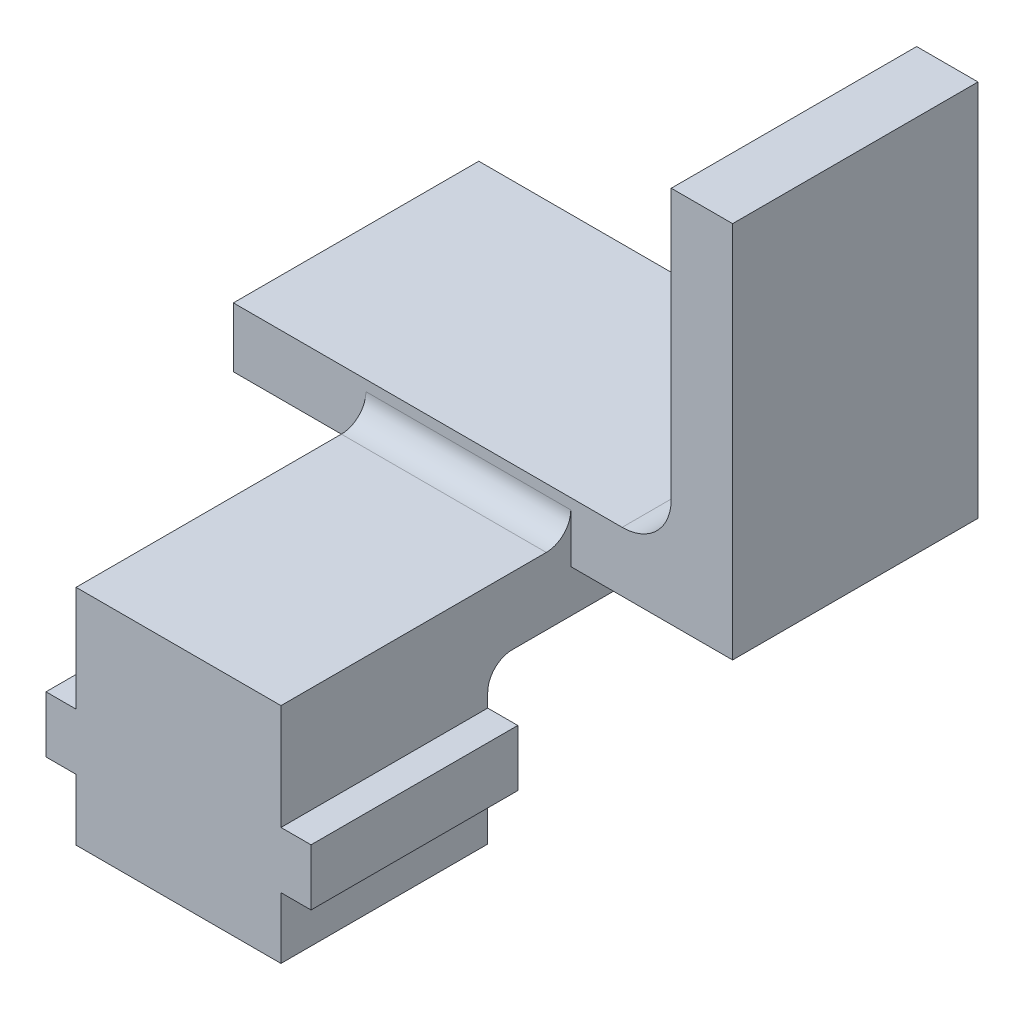
ISO-10303-21;
HEADER;
FILE_DESCRIPTION(('STEP AP214'),'2;1');
FILE_NAME('part.step','',(''),(''),'','','');
FILE_SCHEMA(('AUTOMOTIVE_DESIGN { 1 0 10303 214 1 1 1 1 }'));
ENDSEC;
DATA;
#1=APPLICATION_CONTEXT('core data for automotive mechanical design processes');
#2=APPLICATION_PROTOCOL_DEFINITION('international standard','automotive_design',2000,#1);
#3=PRODUCT_CONTEXT('',#1,'mechanical');
#4=PRODUCT('Part','Part','',(#3));
#5=PRODUCT_RELATED_PRODUCT_CATEGORY('part','',(#4));
#6=PRODUCT_DEFINITION_FORMATION('','',#4);
#7=PRODUCT_DEFINITION_CONTEXT('part definition',#1,'design');
#8=PRODUCT_DEFINITION('design','',#6,#7);
#9=PRODUCT_DEFINITION_SHAPE('','',#8);
#10=(LENGTH_UNIT() NAMED_UNIT(*) SI_UNIT(.MILLI.,.METRE.));
#11=(NAMED_UNIT(*) PLANE_ANGLE_UNIT() SI_UNIT($,.RADIAN.));
#12=(NAMED_UNIT(*) SI_UNIT($,.STERADIAN.) SOLID_ANGLE_UNIT());
#13=UNCERTAINTY_MEASURE_WITH_UNIT(LENGTH_MEASURE(1.E-05),#10,'distance_accuracy_value','');
#14=(GEOMETRIC_REPRESENTATION_CONTEXT(3) GLOBAL_UNCERTAINTY_ASSIGNED_CONTEXT((#13)) GLOBAL_UNIT_ASSIGNED_CONTEXT((#10,
#11,#12)) REPRESENTATION_CONTEXT('',''));
#15=CARTESIAN_POINT('',(0.,0.,0.));
#16=DIRECTION('',(0.,0.,1.));
#17=DIRECTION('',(1.,0.,0.));
#18=AXIS2_PLACEMENT_3D('',#15,#16,#17);
#19=CARTESIAN_POINT('',(0.,-4.191,12.7));
#20=DIRECTION('',(0.,-1.,0.));
#21=DIRECTION('',(1.,0.,0.));
#22=AXIS2_PLACEMENT_3D('',#19,#20,#21);
#23=PLANE('',#22);
#24=DIRECTION('',(1.,0.,0.));
#25=VECTOR('',#24,1.);
#26=CARTESIAN_POINT('',(0.,-4.191,17.));
#27=LINE('',#26,#25);
#28=CARTESIAN_POINT('',(-1.55575,-4.191,17.));
#29=VERTEX_POINT('',#28);
#30=CARTESIAN_POINT('',(0.,-4.191,17.));
#31=VERTEX_POINT('',#30);
#32=EDGE_CURVE('E464',#29,#31,#27,.T.);
#33=ORIENTED_EDGE('',*,*,#32,.F.);
#34=DIRECTION('',(0.,0.,-1.));
#35=VECTOR('',#34,1.);
#36=CARTESIAN_POINT('',(-1.55575,-4.191,12.7));
#37=LINE('',#36,#35);
#38=CARTESIAN_POINT('',(-1.55575,-4.191,27.7));
#39=VERTEX_POINT('',#38);
#40=EDGE_CURVE('E313',#39,#29,#37,.T.);
#41=ORIENTED_EDGE('',*,*,#40,.F.);
#42=DIRECTION('',(-1.,0.,0.));
#43=VECTOR('',#42,1.);
#44=CARTESIAN_POINT('',(0.,-4.191,27.7));
#45=LINE('',#44,#43);
#46=CARTESIAN_POINT('',(0.,-4.191,27.7));
#47=VERTEX_POINT('',#46);
#48=EDGE_CURVE('E454',#47,#39,#45,.T.);
#49=ORIENTED_EDGE('',*,*,#48,.F.);
#50=DIRECTION('',(0.,0.,-1.));
#51=VECTOR('',#50,1.);
#52=CARTESIAN_POINT('',(0.,-4.191,12.7));
#53=LINE('',#52,#51);
#54=EDGE_CURVE('E317',#47,#31,#53,.T.);
#55=ORIENTED_EDGE('',*,*,#54,.T.);
#56=EDGE_LOOP('',(#33,#41,#49,#55));
#57=FACE_BOUND('',#56,.T.);
#58=ADVANCED_FACE('F39',(#57),#23,.F.);
#59=CARTESIAN_POINT('',(-1.55575,-4.191,12.7));
#60=DIRECTION('',(1.,0.,0.));
#61=DIRECTION('',(0.,0.,-1.));
#62=AXIS2_PLACEMENT_3D('',#59,#60,#61);
#63=PLANE('',#62);
#64=DIRECTION('',(0.,1.,0.));
#65=VECTOR('',#64,1.);
#66=CARTESIAN_POINT('',(-1.55575,-4.191,17.));
#67=LINE('',#66,#65);
#68=CARTESIAN_POINT('',(-1.55575,-7.112,17.));
#69=VERTEX_POINT('',#68);
#70=EDGE_CURVE('E467',#69,#29,#67,.T.);
#71=ORIENTED_EDGE('',*,*,#70,.F.);
#72=DIRECTION('',(0.,0.,-1.));
#73=VECTOR('',#72,1.);
#74=CARTESIAN_POINT('',(-1.55575,-7.112,12.7));
#75=LINE('',#74,#73);
#76=CARTESIAN_POINT('',(-1.55575,-7.112,27.7));
#77=VERTEX_POINT('',#76);
#78=EDGE_CURVE('E309',#77,#69,#75,.T.);
#79=ORIENTED_EDGE('',*,*,#78,.F.);
#80=DIRECTION('',(0.,-1.,0.));
#81=VECTOR('',#80,1.);
#82=CARTESIAN_POINT('',(-1.55575,-4.191,27.7));
#83=LINE('',#82,#81);
#84=EDGE_CURVE('E450',#39,#77,#83,.T.);
#85=ORIENTED_EDGE('',*,*,#84,.F.);
#86=ORIENTED_EDGE('',*,*,#40,.T.);
#87=EDGE_LOOP('',(#71,#79,#85,#86));
#88=FACE_BOUND('',#87,.T.);
#89=ADVANCED_FACE('F534',(#88),#63,.F.);
#90=CARTESIAN_POINT('',(-1.55575,-7.112,12.7));
#91=DIRECTION('',(0.,1.,0.));
#92=DIRECTION('',(0.,0.,1.));
#93=AXIS2_PLACEMENT_3D('',#90,#91,#92);
#94=PLANE('',#93);
#95=DIRECTION('',(-1.,0.,0.));
#96=VECTOR('',#95,1.);
#97=CARTESIAN_POINT('',(-1.55575,-7.112,17.));
#98=LINE('',#97,#96);
#99=CARTESIAN_POINT('',(0.,-7.112,17.));
#100=VERTEX_POINT('',#99);
#101=EDGE_CURVE('E470',#100,#69,#98,.T.);
#102=ORIENTED_EDGE('',*,*,#101,.F.);
#103=DIRECTION('',(0.,0.,-1.));
#104=VECTOR('',#103,1.);
#105=CARTESIAN_POINT('',(0.,-7.112,12.7));
#106=LINE('',#105,#104);
#107=CARTESIAN_POINT('',(0.,-7.112,27.7));
#108=VERTEX_POINT('',#107);
#109=EDGE_CURVE('E305',#108,#100,#106,.T.);
#110=ORIENTED_EDGE('',*,*,#109,.F.);
#111=DIRECTION('',(1.,0.,0.));
#112=VECTOR('',#111,1.);
#113=CARTESIAN_POINT('',(-1.55575,-7.112,27.7));
#114=LINE('',#113,#112);
#115=EDGE_CURVE('E446',#77,#108,#114,.T.);
#116=ORIENTED_EDGE('',*,*,#115,.F.);
#117=ORIENTED_EDGE('',*,*,#78,.T.);
#118=EDGE_LOOP('',(#102,#110,#116,#117));
#119=FACE_BOUND('',#118,.T.);
#120=ADVANCED_FACE('F529',(#119),#94,.F.);
#121=CARTESIAN_POINT('',(0.,-7.112,12.7));
#122=DIRECTION('',(1.,0.,0.));
#123=DIRECTION('',(0.,1.,0.));
#124=AXIS2_PLACEMENT_3D('',#121,#122,#123);
#125=PLANE('',#124);
#126=DIRECTION('',(0.,1.,0.));
#127=VECTOR('',#126,1.);
#128=CARTESIAN_POINT('',(0.,-7.112,17.));
#129=LINE('',#128,#127);
#130=CARTESIAN_POINT('',(0.,-10.287,17.));
#131=VERTEX_POINT('',#130);
#132=EDGE_CURVE('E473',#131,#100,#129,.T.);
#133=ORIENTED_EDGE('',*,*,#132,.F.);
#134=DIRECTION('',(0.,0.,-1.));
#135=VECTOR('',#134,1.);
#136=CARTESIAN_POINT('',(0.,-10.287,12.7));
#137=LINE('',#136,#135);
#138=CARTESIAN_POINT('',(0.,-10.287,27.7));
#139=VERTEX_POINT('',#138);
#140=EDGE_CURVE('E301',#139,#131,#137,.T.);
#141=ORIENTED_EDGE('',*,*,#140,.F.);
#142=DIRECTION('',(0.,-1.,0.));
#143=VECTOR('',#142,1.);
#144=CARTESIAN_POINT('',(0.,-7.112,27.7));
#145=LINE('',#144,#143);
#146=EDGE_CURVE('E442',#108,#139,#145,.T.);
#147=ORIENTED_EDGE('',*,*,#146,.F.);
#148=ORIENTED_EDGE('',*,*,#109,.T.);
#149=EDGE_LOOP('',(#133,#141,#147,#148));
#150=FACE_BOUND('',#149,.T.);
#151=ADVANCED_FACE('F526',(#150),#125,.F.);
#152=CARTESIAN_POINT('',(0.,-10.287,12.7));
#153=DIRECTION('',(0.,1.,0.));
#154=DIRECTION('',(0.,0.,1.));
#155=AXIS2_PLACEMENT_3D('',#152,#153,#154);
#156=PLANE('',#155);
#157=DIRECTION('',(-1.,0.,0.));
#158=VECTOR('',#157,1.);
#159=CARTESIAN_POINT('',(0.,-10.287,17.));
#160=LINE('',#159,#158);
#161=CARTESIAN_POINT('',(10.6045,-10.287,17.));
#162=VERTEX_POINT('',#161);
#163=EDGE_CURVE('E476',#162,#131,#160,.T.);
#164=ORIENTED_EDGE('',*,*,#163,.F.);
#165=DIRECTION('',(0.,0.,-1.));
#166=VECTOR('',#165,1.);
#167=CARTESIAN_POINT('',(10.6045,-10.287,12.7));
#168=LINE('',#167,#166);
#169=CARTESIAN_POINT('',(10.6045,-10.287,27.7));
#170=VERTEX_POINT('',#169);
#171=EDGE_CURVE('E297',#170,#162,#168,.T.);
#172=ORIENTED_EDGE('',*,*,#171,.F.);
#173=DIRECTION('',(1.,0.,0.));
#174=VECTOR('',#173,1.);
#175=CARTESIAN_POINT('',(0.,-10.287,27.7));
#176=LINE('',#175,#174);
#177=EDGE_CURVE('E438',#139,#170,#176,.T.);
#178=ORIENTED_EDGE('',*,*,#177,.F.);
#179=ORIENTED_EDGE('',*,*,#140,.T.);
#180=EDGE_LOOP('',(#164,#172,#178,#179));
#181=FACE_BOUND('',#180,.T.);
#182=ADVANCED_FACE('F522',(#181),#156,.F.);
#183=CARTESIAN_POINT('',(10.6045,-10.287,12.7));
#184=DIRECTION('',(-1.,0.,0.));
#185=DIRECTION('',(0.,0.,1.));
#186=AXIS2_PLACEMENT_3D('',#183,#184,#185);
#187=PLANE('',#186);
#188=DIRECTION('',(0.,-1.,0.));
#189=VECTOR('',#188,1.);
#190=CARTESIAN_POINT('',(10.6045,-10.287,17.));
#191=LINE('',#190,#189);
#192=CARTESIAN_POINT('',(10.6045,-7.112,17.));
#193=VERTEX_POINT('',#192);
#194=EDGE_CURVE('E479',#193,#162,#191,.T.);
#195=ORIENTED_EDGE('',*,*,#194,.F.);
#196=DIRECTION('',(0.,0.,-1.));
#197=VECTOR('',#196,1.);
#198=CARTESIAN_POINT('',(10.6045,-7.112,12.7));
#199=LINE('',#198,#197);
#200=CARTESIAN_POINT('',(10.6045,-7.112,27.7));
#201=VERTEX_POINT('',#200);
#202=EDGE_CURVE('E293',#201,#193,#199,.T.);
#203=ORIENTED_EDGE('',*,*,#202,.F.);
#204=DIRECTION('',(0.,1.,0.));
#205=VECTOR('',#204,1.);
#206=CARTESIAN_POINT('',(10.6045,-10.287,27.7));
#207=LINE('',#206,#205);
#208=EDGE_CURVE('E434',#170,#201,#207,.T.);
#209=ORIENTED_EDGE('',*,*,#208,.F.);
#210=ORIENTED_EDGE('',*,*,#171,.T.);
#211=EDGE_LOOP('',(#195,#203,#209,#210));
#212=FACE_BOUND('',#211,.T.);
#213=ADVANCED_FACE('F517',(#212),#187,.F.);
#214=CARTESIAN_POINT('',(10.6045,-7.112,12.7));
#215=DIRECTION('',(0.,1.,0.));
#216=DIRECTION('',(0.,0.,1.));
#217=AXIS2_PLACEMENT_3D('',#214,#215,#216);
#218=PLANE('',#217);
#219=DIRECTION('',(-1.,0.,0.));
#220=VECTOR('',#219,1.);
#221=CARTESIAN_POINT('',(10.6045,-7.112,17.));
#222=LINE('',#221,#220);
#223=CARTESIAN_POINT('',(12.16025,-7.112,17.));
#224=VERTEX_POINT('',#223);
#225=EDGE_CURVE('E482',#224,#193,#222,.T.);
#226=ORIENTED_EDGE('',*,*,#225,.F.);
#227=DIRECTION('',(0.,0.,-1.));
#228=VECTOR('',#227,1.);
#229=CARTESIAN_POINT('',(12.16025,-7.112,12.7));
#230=LINE('',#229,#228);
#231=CARTESIAN_POINT('',(12.16025,-7.112,27.7));
#232=VERTEX_POINT('',#231);
#233=EDGE_CURVE('E289',#232,#224,#230,.T.);
#234=ORIENTED_EDGE('',*,*,#233,.F.);
#235=DIRECTION('',(1.,0.,0.));
#236=VECTOR('',#235,1.);
#237=CARTESIAN_POINT('',(10.6045,-7.112,27.7));
#238=LINE('',#237,#236);
#239=EDGE_CURVE('E430',#201,#232,#238,.T.);
#240=ORIENTED_EDGE('',*,*,#239,.F.);
#241=ORIENTED_EDGE('',*,*,#202,.T.);
#242=EDGE_LOOP('',(#226,#234,#240,#241));
#243=FACE_BOUND('',#242,.T.);
#244=ADVANCED_FACE('F514',(#243),#218,.F.);
#245=CARTESIAN_POINT('',(12.16025,-7.112,12.7));
#246=DIRECTION('',(-1.,0.,0.));
#247=DIRECTION('',(0.,0.,1.));
#248=AXIS2_PLACEMENT_3D('',#245,#246,#247);
#249=PLANE('',#248);
#250=DIRECTION('',(0.,-1.,0.));
#251=VECTOR('',#250,1.);
#252=CARTESIAN_POINT('',(12.16025,-7.112,17.));
#253=LINE('',#252,#251);
#254=CARTESIAN_POINT('',(12.16025,-4.191,17.));
#255=VERTEX_POINT('',#254);
#256=EDGE_CURVE('E485',#255,#224,#253,.T.);
#257=ORIENTED_EDGE('',*,*,#256,.F.);
#258=DIRECTION('',(0.,0.,-1.));
#259=VECTOR('',#258,1.);
#260=CARTESIAN_POINT('',(12.16025,-4.191,12.7));
#261=LINE('',#260,#259);
#262=CARTESIAN_POINT('',(12.16025,-4.191,27.7));
#263=VERTEX_POINT('',#262);
#264=EDGE_CURVE('E285',#263,#255,#261,.T.);
#265=ORIENTED_EDGE('',*,*,#264,.F.);
#266=DIRECTION('',(0.,1.,0.));
#267=VECTOR('',#266,1.);
#268=CARTESIAN_POINT('',(12.16025,-7.112,27.7));
#269=LINE('',#268,#267);
#270=EDGE_CURVE('E426',#232,#263,#269,.T.);
#271=ORIENTED_EDGE('',*,*,#270,.F.);
#272=ORIENTED_EDGE('',*,*,#233,.T.);
#273=EDGE_LOOP('',(#257,#265,#271,#272));
#274=FACE_BOUND('',#273,.T.);
#275=ADVANCED_FACE('F510',(#274),#249,.F.);
#276=CARTESIAN_POINT('',(12.16025,-4.191,12.7));
#277=DIRECTION('',(0.,-1.,0.));
#278=DIRECTION('',(1.,0.,0.));
#279=AXIS2_PLACEMENT_3D('',#276,#277,#278);
#280=PLANE('',#279);
#281=DIRECTION('',(1.,0.,0.));
#282=VECTOR('',#281,1.);
#283=CARTESIAN_POINT('',(12.16025,-4.191,17.));
#284=LINE('',#283,#282);
#285=CARTESIAN_POINT('',(10.6045,-4.191,17.));
#286=VERTEX_POINT('',#285);
#287=EDGE_CURVE('E488',#286,#255,#284,.T.);
#288=ORIENTED_EDGE('',*,*,#287,.F.);
#289=DIRECTION('',(0.,0.,-1.));
#290=VECTOR('',#289,1.);
#291=CARTESIAN_POINT('',(10.6045,-4.191,12.7));
#292=LINE('',#291,#290);
#293=CARTESIAN_POINT('',(10.6045,-4.191,27.7));
#294=VERTEX_POINT('',#293);
#295=EDGE_CURVE('E281',#294,#286,#292,.T.);
#296=ORIENTED_EDGE('',*,*,#295,.F.);
#297=DIRECTION('',(-1.,0.,0.));
#298=VECTOR('',#297,1.);
#299=CARTESIAN_POINT('',(12.16025,-4.191,27.7));
#300=LINE('',#299,#298);
#301=EDGE_CURVE('E422',#263,#294,#300,.T.);
#302=ORIENTED_EDGE('',*,*,#301,.F.);
#303=ORIENTED_EDGE('',*,*,#264,.T.);
#304=EDGE_LOOP('',(#288,#296,#302,#303));
#305=FACE_BOUND('',#304,.T.);
#306=ADVANCED_FACE('F503',(#305),#280,.F.);
#307=CARTESIAN_POINT('',(0.,0.,12.7));
#308=DIRECTION('',(0.,0.,-1.));
#309=DIRECTION('',(-1.,0.,0.));
#310=AXIS2_PLACEMENT_3D('',#307,#308,#309);
#311=PLANE('',#310);
#312=DIRECTION('',(0.,-1.,0.));
#313=VECTOR('',#312,1.);
#314=CARTESIAN_POINT('',(0.,0.,12.7));
#315=LINE('',#314,#313);
#316=CARTESIAN_POINT('',(0.,2.54,12.7));
#317=VERTEX_POINT('',#316);
#318=CARTESIAN_POINT('',(0.,0.,12.7));
#319=VERTEX_POINT('',#318);
#320=EDGE_CURVE('E55',#317,#319,#315,.T.);
#321=ORIENTED_EDGE('',*,*,#320,.F.);
#322=DIRECTION('',(-1.,0.,0.));
#323=VECTOR('',#322,1.);
#324=CARTESIAN_POINT('',(10.6045,2.54,12.7));
#325=LINE('',#324,#323);
#326=CARTESIAN_POINT('',(10.6045,2.54,12.7));
#327=VERTEX_POINT('',#326);
#328=EDGE_CURVE('E351',#317,#327,#325,.F.);
#329=ORIENTED_EDGE('',*,*,#328,.T.);
#330=DIRECTION('',(0.,1.,0.));
#331=VECTOR('',#330,1.);
#332=CARTESIAN_POINT('',(10.6045,1.27,12.7));
#333=LINE('',#332,#331);
#334=CARTESIAN_POINT('',(10.6045,0.,12.7));
#335=VERTEX_POINT('',#334);
#336=EDGE_CURVE('E62',#335,#327,#333,.T.);
#337=ORIENTED_EDGE('',*,*,#336,.F.);
#338=DIRECTION('',(1.,0.,0.));
#339=VECTOR('',#338,1.);
#340=CARTESIAN_POINT('',(10.6045,0.,12.7));
#341=LINE('',#340,#339);
#342=CARTESIAN_POINT('',(18.97725,0.,12.7));
#343=VERTEX_POINT('',#342);
#344=EDGE_CURVE('E370',#335,#343,#341,.T.);
#345=ORIENTED_EDGE('',*,*,#344,.T.);
#346=DIRECTION('',(0.,1.,0.));
#347=VECTOR('',#346,1.);
#348=CARTESIAN_POINT('',(18.97725,0.,12.7));
#349=LINE('',#348,#347);
#350=CARTESIAN_POINT('',(18.97725,19.558,12.7));
#351=VERTEX_POINT('',#350);
#352=EDGE_CURVE('E378',#343,#351,#349,.T.);
#353=ORIENTED_EDGE('',*,*,#352,.T.);
#354=DIRECTION('',(-1.,0.,0.));
#355=VECTOR('',#354,1.);
#356=CARTESIAN_POINT('',(18.97725,19.558,12.7));
#357=LINE('',#356,#355);
#358=CARTESIAN_POINT('',(15.80225,19.558,12.7));
#359=VERTEX_POINT('',#358);
#360=EDGE_CURVE('E382',#351,#359,#357,.T.);
#361=ORIENTED_EDGE('',*,*,#360,.T.);
#362=DIRECTION('',(0.,-1.,0.));
#363=VECTOR('',#362,1.);
#364=CARTESIAN_POINT('',(15.80225,19.558,12.7));
#365=LINE('',#364,#363);
#366=CARTESIAN_POINT('',(15.80225,5.629,12.7));
#367=VERTEX_POINT('',#366);
#368=EDGE_CURVE('E389',#359,#367,#365,.T.);
#369=ORIENTED_EDGE('',*,*,#368,.T.);
#370=CARTESIAN_POINT('',(13.26225,5.629,12.7));
#371=DIRECTION('',(0.,0.,-1.));
#372=DIRECTION('',(-1.,0.,0.));
#373=AXIS2_PLACEMENT_3D('',#370,#371,#372);
#374=CIRCLE('',#373,2.54);
#375=CARTESIAN_POINT('',(13.26225,3.089,12.7));
#376=VERTEX_POINT('',#375);
#377=EDGE_CURVE('E335',#367,#376,#374,.T.);
#378=ORIENTED_EDGE('',*,*,#377,.T.);
#379=DIRECTION('',(-1.,0.,0.));
#380=VECTOR('',#379,1.);
#381=CARTESIAN_POINT('',(15.80225,3.089,12.7));
#382=LINE('',#381,#380);
#383=CARTESIAN_POINT('',(-6.858,3.089,12.7));
#384=VERTEX_POINT('',#383);
#385=EDGE_CURVE('E393',#376,#384,#382,.T.);
#386=ORIENTED_EDGE('',*,*,#385,.T.);
#387=DIRECTION('',(0.,-1.,0.));
#388=VECTOR('',#387,1.);
#389=CARTESIAN_POINT('',(-6.858,3.089,12.7));
#390=LINE('',#389,#388);
#391=CARTESIAN_POINT('',(-6.858,0.,12.7));
#392=VERTEX_POINT('',#391);
#393=EDGE_CURVE('E262',#384,#392,#390,.T.);
#394=ORIENTED_EDGE('',*,*,#393,.T.);
#395=DIRECTION('',(1.,0.,0.));
#396=VECTOR('',#395,1.);
#397=CARTESIAN_POINT('',(-6.858,0.,12.7));
#398=LINE('',#397,#396);
#399=EDGE_CURVE('E256',#392,#319,#398,.T.);
#400=ORIENTED_EDGE('',*,*,#399,.T.);
#401=EDGE_LOOP('',(#321,#329,#337,#345,#353,#361,#369,#378,#386,#394,#400));
#402=FACE_BOUND('',#401,.T.);
#403=ADVANCED_FACE('F368',(#402),#311,.F.);
#404=CARTESIAN_POINT('',(-6.858,0.,12.7));
#405=DIRECTION('',(0.,1.,0.));
#406=DIRECTION('',(0.,0.,1.));
#407=AXIS2_PLACEMENT_3D('',#404,#405,#406);
#408=PLANE('',#407);
#409=DIRECTION('',(1.,0.,0.));
#410=VECTOR('',#409,1.);
#411=CARTESIAN_POINT('',(-6.858,0.,0.));
#412=LINE('',#411,#410);
#413=CARTESIAN_POINT('',(-6.858,0.,0.));
#414=VERTEX_POINT('',#413);
#415=CARTESIAN_POINT('',(0.,0.,0.));
#416=VERTEX_POINT('',#415);
#417=EDGE_CURVE('E237',#414,#416,#412,.T.);
#418=ORIENTED_EDGE('',*,*,#417,.T.);
#419=DIRECTION('',(0.,0.,-1.));
#420=VECTOR('',#419,1.);
#421=CARTESIAN_POINT('',(0.,0.,12.7));
#422=LINE('',#421,#420);
#423=EDGE_CURVE('E321',#319,#416,#422,.T.);
#424=ORIENTED_EDGE('',*,*,#423,.F.);
#425=ORIENTED_EDGE('',*,*,#399,.F.);
#426=DIRECTION('',(0.,0.,-1.));
#427=VECTOR('',#426,1.);
#428=CARTESIAN_POINT('',(-6.858,0.,12.7));
#429=LINE('',#428,#427);
#430=EDGE_CURVE('E257',#392,#414,#429,.T.);
#431=ORIENTED_EDGE('',*,*,#430,.T.);
#432=EDGE_LOOP('',(#418,#424,#425,#431));
#433=FACE_BOUND('',#432,.T.);
#434=ADVANCED_FACE('F559',(#433),#408,.F.);
#435=CARTESIAN_POINT('',(0.,0.,12.7));
#436=DIRECTION('',(1.,0.,0.));
#437=DIRECTION('',(0.,1.,0.));
#438=AXIS2_PLACEMENT_3D('',#435,#436,#437);
#439=PLANE('',#438);
#440=DIRECTION('',(0.,-1.,0.));
#441=VECTOR('',#440,1.);
#442=CARTESIAN_POINT('',(0.,0.,0.));
#443=LINE('',#442,#441);
#444=CARTESIAN_POINT('',(0.,-2.211,0.));
#445=VERTEX_POINT('',#444);
#446=EDGE_CURVE('E231',#416,#445,#443,.T.);
#447=ORIENTED_EDGE('',*,*,#446,.T.);
#448=DIRECTION('',(0.,0.,1.));
#449=VECTOR('',#448,1.);
#450=CARTESIAN_POINT('',(0.,-2.211,12.7));
#451=LINE('',#450,#449);
#452=CARTESIAN_POINT('',(0.,-2.211,15.73));
#453=VERTEX_POINT('',#452);
#454=EDGE_CURVE('E215',#445,#453,#451,.T.);
#455=ORIENTED_EDGE('',*,*,#454,.T.);
#456=CARTESIAN_POINT('',(0.,-3.481,15.73));
#457=DIRECTION('',(1.,0.,0.));
#458=DIRECTION('',(0.,1.,0.));
#459=AXIS2_PLACEMENT_3D('',#456,#457,#458);
#460=CIRCLE('',#459,1.27);
#461=CARTESIAN_POINT('',(0.,-3.481,17.));
#462=VERTEX_POINT('',#461);
#463=EDGE_CURVE('E356',#453,#462,#460,.T.);
#464=ORIENTED_EDGE('',*,*,#463,.T.);
#465=DIRECTION('',(0.,1.,0.));
#466=VECTOR('',#465,1.);
#467=CARTESIAN_POINT('',(0.,0.,17.));
#468=LINE('',#467,#466);
#469=EDGE_CURVE('E414',#31,#462,#468,.T.);
#470=ORIENTED_EDGE('',*,*,#469,.F.);
#471=ORIENTED_EDGE('',*,*,#54,.F.);
#472=DIRECTION('',(0.,-1.,0.));
#473=VECTOR('',#472,1.);
#474=CARTESIAN_POINT('',(0.,0.,27.7));
#475=LINE('',#474,#473);
#476=CARTESIAN_POINT('',(0.,1.27,27.7));
#477=VERTEX_POINT('',#476);
#478=EDGE_CURVE('E413',#477,#47,#475,.T.);
#479=ORIENTED_EDGE('',*,*,#478,.F.);
#480=DIRECTION('',(0.,0.,-1.));
#481=VECTOR('',#480,1.);
#482=CARTESIAN_POINT('',(0.,1.27,27.7));
#483=LINE('',#482,#481);
#484=CARTESIAN_POINT('',(0.,1.27,13.97));
#485=VERTEX_POINT('',#484);
#486=EDGE_CURVE('E364',#477,#485,#483,.T.);
#487=ORIENTED_EDGE('',*,*,#486,.T.);
#488=CARTESIAN_POINT('',(0.,2.54,13.97));
#489=DIRECTION('',(1.,0.,0.));
#490=DIRECTION('',(0.,1.,0.));
#491=AXIS2_PLACEMENT_3D('',#488,#489,#490);
#492=CIRCLE('',#491,1.27);
#493=EDGE_CURVE('E48',#485,#317,#492,.T.);
#494=ORIENTED_EDGE('',*,*,#493,.T.);
#495=ORIENTED_EDGE('',*,*,#320,.T.);
#496=ORIENTED_EDGE('',*,*,#423,.T.);
#497=EDGE_LOOP('',(#447,#455,#464,#470,#471,#479,#487,#494,#495,#496));
#498=FACE_BOUND('',#497,.T.);
#499=ADVANCED_FACE('F362',(#498),#439,.F.);
#500=CARTESIAN_POINT('',(10.6045,-4.191,12.7));
#501=DIRECTION('',(-1.,0.,0.));
#502=DIRECTION('',(0.,0.,1.));
#503=AXIS2_PLACEMENT_3D('',#500,#501,#502);
#504=PLANE('',#503);
#505=DIRECTION('',(0.,-1.,0.));
#506=VECTOR('',#505,1.);
#507=CARTESIAN_POINT('',(10.6045,-4.191,17.));
#508=LINE('',#507,#506);
#509=CARTESIAN_POINT('',(10.6045,-3.481,17.));
#510=VERTEX_POINT('',#509);
#511=EDGE_CURVE('E224',#510,#286,#508,.T.);
#512=ORIENTED_EDGE('',*,*,#511,.F.);
#513=CARTESIAN_POINT('',(10.6045,-3.481,15.73));
#514=DIRECTION('',(-1.,0.,0.));
#515=DIRECTION('',(0.,0.,1.));
#516=AXIS2_PLACEMENT_3D('',#513,#514,#515);
#517=CIRCLE('',#516,1.27);
#518=CARTESIAN_POINT('',(10.6045,-2.211,15.73));
#519=VERTEX_POINT('',#518);
#520=EDGE_CURVE('E211',#510,#519,#517,.T.);
#521=ORIENTED_EDGE('',*,*,#520,.T.);
#522=DIRECTION('',(0.,0.,-1.));
#523=VECTOR('',#522,1.);
#524=CARTESIAN_POINT('',(10.6045,-2.211,12.7));
#525=LINE('',#524,#523);
#526=CARTESIAN_POINT('',(10.6045,-2.211,0.));
#527=VERTEX_POINT('',#526);
#528=EDGE_CURVE('E204',#519,#527,#525,.T.);
#529=ORIENTED_EDGE('',*,*,#528,.T.);
#530=DIRECTION('',(0.,1.,0.));
#531=VECTOR('',#530,1.);
#532=CARTESIAN_POINT('',(10.6045,-4.191,0.));
#533=LINE('',#532,#531);
#534=CARTESIAN_POINT('',(10.6045,0.,0.));
#535=VERTEX_POINT('',#534);
#536=EDGE_CURVE('E209',#527,#535,#533,.T.);
#537=ORIENTED_EDGE('',*,*,#536,.T.);
#538=DIRECTION('',(0.,0.,-1.));
#539=VECTOR('',#538,1.);
#540=CARTESIAN_POINT('',(10.6045,0.,12.7));
#541=LINE('',#540,#539);
#542=EDGE_CURVE('E278',#335,#535,#541,.T.);
#543=ORIENTED_EDGE('',*,*,#542,.F.);
#544=ORIENTED_EDGE('',*,*,#336,.T.);
#545=CARTESIAN_POINT('',(10.6045,2.54,13.97));
#546=DIRECTION('',(-1.,0.,0.));
#547=DIRECTION('',(0.,0.,1.));
#548=AXIS2_PLACEMENT_3D('',#545,#546,#547);
#549=CIRCLE('',#548,1.27);
#550=CARTESIAN_POINT('',(10.6045,1.27,13.97));
#551=VERTEX_POINT('',#550);
#552=EDGE_CURVE('E11',#327,#551,#549,.T.);
#553=ORIENTED_EDGE('',*,*,#552,.T.);
#554=DIRECTION('',(0.,0.,-1.));
#555=VECTOR('',#554,1.);
#556=CARTESIAN_POINT('',(10.6045,1.27,27.7));
#557=LINE('',#556,#555);
#558=CARTESIAN_POINT('',(10.6045,1.27,27.7));
#559=VERTEX_POINT('',#558);
#560=EDGE_CURVE('E399',#559,#551,#557,.T.);
#561=ORIENTED_EDGE('',*,*,#560,.F.);
#562=DIRECTION('',(0.,1.,0.));
#563=VECTOR('',#562,1.);
#564=CARTESIAN_POINT('',(10.6045,-4.191,27.7));
#565=LINE('',#564,#563);
#566=EDGE_CURVE('E419',#294,#559,#565,.T.);
#567=ORIENTED_EDGE('',*,*,#566,.F.);
#568=ORIENTED_EDGE('',*,*,#295,.T.);
#569=EDGE_LOOP('',(#512,#521,#529,#537,#543,#544,#553,#561,#567,#568));
#570=FACE_BOUND('',#569,.T.);
#571=ADVANCED_FACE('F207',(#570),#504,.F.);
#572=CARTESIAN_POINT('',(10.6045,0.,12.7));
#573=DIRECTION('',(0.,1.,0.));
#574=DIRECTION('',(0.,0.,1.));
#575=AXIS2_PLACEMENT_3D('',#572,#573,#574);
#576=PLANE('',#575);
#577=DIRECTION('',(1.,0.,0.));
#578=VECTOR('',#577,1.);
#579=CARTESIAN_POINT('',(10.6045,0.,0.));
#580=LINE('',#579,#578);
#581=CARTESIAN_POINT('',(18.97725,0.,0.));
#582=VERTEX_POINT('',#581);
#583=EDGE_CURVE('E229',#535,#582,#580,.T.);
#584=ORIENTED_EDGE('',*,*,#583,.T.);
#585=DIRECTION('',(0.,0.,-1.));
#586=VECTOR('',#585,1.);
#587=CARTESIAN_POINT('',(18.97725,0.,12.7));
#588=LINE('',#587,#586);
#589=EDGE_CURVE('E274',#343,#582,#588,.T.);
#590=ORIENTED_EDGE('',*,*,#589,.F.);
#591=ORIENTED_EDGE('',*,*,#344,.F.);
#592=ORIENTED_EDGE('',*,*,#542,.T.);
#593=EDGE_LOOP('',(#584,#590,#591,#592));
#594=FACE_BOUND('',#593,.T.);
#595=ADVANCED_FACE('F375',(#594),#576,.F.);
#596=CARTESIAN_POINT('',(18.97725,0.,12.7));
#597=DIRECTION('',(-1.,0.,0.));
#598=DIRECTION('',(0.,-1.,0.));
#599=AXIS2_PLACEMENT_3D('',#596,#597,#598);
#600=PLANE('',#599);
#601=DIRECTION('',(0.,1.,0.));
#602=VECTOR('',#601,1.);
#603=CARTESIAN_POINT('',(18.97725,0.,0.));
#604=LINE('',#603,#602);
#605=CARTESIAN_POINT('',(18.97725,19.558,0.));
#606=VERTEX_POINT('',#605);
#607=EDGE_CURVE('E235',#582,#606,#604,.T.);
#608=ORIENTED_EDGE('',*,*,#607,.T.);
#609=DIRECTION('',(0.,0.,-1.));
#610=VECTOR('',#609,1.);
#611=CARTESIAN_POINT('',(18.97725,19.558,12.7));
#612=LINE('',#611,#610);
#613=EDGE_CURVE('E270',#351,#606,#612,.T.);
#614=ORIENTED_EDGE('',*,*,#613,.F.);
#615=ORIENTED_EDGE('',*,*,#352,.F.);
#616=ORIENTED_EDGE('',*,*,#589,.T.);
#617=EDGE_LOOP('',(#608,#614,#615,#616));
#618=FACE_BOUND('',#617,.T.);
#619=ADVANCED_FACE('F701',(#618),#600,.F.);
#620=CARTESIAN_POINT('',(18.97725,19.558,12.7));
#621=DIRECTION('',(0.,-1.,0.));
#622=DIRECTION('',(0.,0.,-1.));
#623=AXIS2_PLACEMENT_3D('',#620,#621,#622);
#624=PLANE('',#623);
#625=DIRECTION('',(-1.,0.,0.));
#626=VECTOR('',#625,1.);
#627=CARTESIAN_POINT('',(18.97725,19.558,0.));
#628=LINE('',#627,#626);
#629=CARTESIAN_POINT('',(15.80225,19.558,0.));
#630=VERTEX_POINT('',#629);
#631=EDGE_CURVE('E243',#606,#630,#628,.T.);
#632=ORIENTED_EDGE('',*,*,#631,.T.);
#633=DIRECTION('',(0.,0.,-1.));
#634=VECTOR('',#633,1.);
#635=CARTESIAN_POINT('',(15.80225,19.558,12.7));
#636=LINE('',#635,#634);
#637=EDGE_CURVE('E266',#359,#630,#636,.T.);
#638=ORIENTED_EDGE('',*,*,#637,.F.);
#639=ORIENTED_EDGE('',*,*,#360,.F.);
#640=ORIENTED_EDGE('',*,*,#613,.T.);
#641=EDGE_LOOP('',(#632,#638,#639,#640));
#642=FACE_BOUND('',#641,.T.);
#643=ADVANCED_FACE('F706',(#642),#624,.F.);
#644=CARTESIAN_POINT('',(15.80225,19.558,12.7));
#645=DIRECTION('',(1.,0.,0.));
#646=DIRECTION('',(0.,0.,-1.));
#647=AXIS2_PLACEMENT_3D('',#644,#645,#646);
#648=PLANE('',#647);
#649=DIRECTION('',(0.,-1.,0.));
#650=VECTOR('',#649,1.);
#651=CARTESIAN_POINT('',(15.80225,19.558,0.));
#652=LINE('',#651,#650);
#653=CARTESIAN_POINT('',(15.80225,5.629,0.));
#654=VERTEX_POINT('',#653);
#655=EDGE_CURVE('E246',#630,#654,#652,.T.);
#656=ORIENTED_EDGE('',*,*,#655,.T.);
#657=DIRECTION('',(0.,0.,-1.));
#658=VECTOR('',#657,1.);
#659=CARTESIAN_POINT('',(15.80225,5.629,12.7));
#660=LINE('',#659,#658);
#661=EDGE_CURVE('E329',#654,#367,#660,.F.);
#662=ORIENTED_EDGE('',*,*,#661,.T.);
#663=ORIENTED_EDGE('',*,*,#368,.F.);
#664=ORIENTED_EDGE('',*,*,#637,.T.);
#665=EDGE_LOOP('',(#656,#662,#663,#664));
#666=FACE_BOUND('',#665,.T.);
#667=ADVANCED_FACE('F714',(#666),#648,.F.);
#668=CARTESIAN_POINT('',(15.80225,3.089,12.7));
#669=DIRECTION('',(0.,-1.,0.));
#670=DIRECTION('',(1.,0.,0.));
#671=AXIS2_PLACEMENT_3D('',#668,#669,#670);
#672=PLANE('',#671);
#673=ORIENTED_EDGE('',*,*,#385,.F.);
#674=DIRECTION('',(0.,0.,-1.));
#675=VECTOR('',#674,1.);
#676=CARTESIAN_POINT('',(13.26225,3.089,0.));
#677=LINE('',#676,#675);
#678=CARTESIAN_POINT('',(13.26225,3.089,0.));
#679=VERTEX_POINT('',#678);
#680=EDGE_CURVE('E325',#376,#679,#677,.T.);
#681=ORIENTED_EDGE('',*,*,#680,.T.);
#682=DIRECTION('',(-1.,0.,0.));
#683=VECTOR('',#682,1.);
#684=CARTESIAN_POINT('',(15.80225,3.089,0.));
#685=LINE('',#684,#683);
#686=CARTESIAN_POINT('',(-6.858,3.089,0.));
#687=VERTEX_POINT('',#686);
#688=EDGE_CURVE('E250',#679,#687,#685,.T.);
#689=ORIENTED_EDGE('',*,*,#688,.T.);
#690=DIRECTION('',(0.,0.,-1.));
#691=VECTOR('',#690,1.);
#692=CARTESIAN_POINT('',(-6.858,3.089,12.7));
#693=LINE('',#692,#691);
#694=EDGE_CURVE('E261',#384,#687,#693,.T.);
#695=ORIENTED_EDGE('',*,*,#694,.F.);
#696=EDGE_LOOP('',(#673,#681,#689,#695));
#697=FACE_BOUND('',#696,.T.);
#698=ADVANCED_FACE('F723',(#697),#672,.F.);
#699=CARTESIAN_POINT('',(-6.858,3.089,12.7));
#700=DIRECTION('',(1.,0.,0.));
#701=DIRECTION('',(0.,0.,-1.));
#702=AXIS2_PLACEMENT_3D('',#699,#700,#701);
#703=PLANE('',#702);
#704=DIRECTION('',(0.,-1.,0.));
#705=VECTOR('',#704,1.);
#706=CARTESIAN_POINT('',(-6.858,3.089,0.));
#707=LINE('',#706,#705);
#708=EDGE_CURVE('E253',#687,#414,#707,.T.);
#709=ORIENTED_EDGE('',*,*,#708,.T.);
#710=ORIENTED_EDGE('',*,*,#430,.F.);
#711=ORIENTED_EDGE('',*,*,#393,.F.);
#712=ORIENTED_EDGE('',*,*,#694,.T.);
#713=EDGE_LOOP('',(#709,#710,#711,#712));
#714=FACE_BOUND('',#713,.T.);
#715=ADVANCED_FACE('F667',(#714),#703,.F.);
#716=CARTESIAN_POINT('',(0.,0.,0.));
#717=DIRECTION('',(0.,0.,-1.));
#718=DIRECTION('',(-1.,0.,0.));
#719=AXIS2_PLACEMENT_3D('',#716,#717,#718);
#720=PLANE('',#719);
#721=DIRECTION('',(1.,0.,0.));
#722=VECTOR('',#721,1.);
#723=CARTESIAN_POINT('',(0.,-2.211,0.));
#724=LINE('',#723,#722);
#725=EDGE_CURVE('E218',#445,#527,#724,.T.);
#726=ORIENTED_EDGE('',*,*,#725,.F.);
#727=ORIENTED_EDGE('',*,*,#446,.F.);
#728=ORIENTED_EDGE('',*,*,#417,.F.);
#729=ORIENTED_EDGE('',*,*,#708,.F.);
#730=ORIENTED_EDGE('',*,*,#688,.F.);
#731=CARTESIAN_POINT('',(13.26225,5.629,0.));
#732=DIRECTION('',(0.,0.,-1.));
#733=DIRECTION('',(-1.,0.,0.));
#734=AXIS2_PLACEMENT_3D('',#731,#732,#733);
#735=CIRCLE('',#734,2.54);
#736=EDGE_CURVE('E332',#679,#654,#735,.F.);
#737=ORIENTED_EDGE('',*,*,#736,.T.);
#738=ORIENTED_EDGE('',*,*,#655,.F.);
#739=ORIENTED_EDGE('',*,*,#631,.F.);
#740=ORIENTED_EDGE('',*,*,#607,.F.);
#741=ORIENTED_EDGE('',*,*,#583,.F.);
#742=ORIENTED_EDGE('',*,*,#536,.F.);
#743=EDGE_LOOP('',(#726,#727,#728,#729,#730,#737,#738,#739,#740,#741,#742));
#744=FACE_BOUND('',#743,.T.);
#745=ADVANCED_FACE('F227',(#744),#720,.T.);
#746=CARTESIAN_POINT('',(13.26225,5.629,12.7));
#747=DIRECTION('',(0.,0.,1.));
#748=DIRECTION('',(1.,0.,0.));
#749=AXIS2_PLACEMENT_3D('',#746,#747,#748);
#750=CYLINDRICAL_SURFACE('',#749,2.54);
#751=ORIENTED_EDGE('',*,*,#377,.F.);
#752=ORIENTED_EDGE('',*,*,#661,.F.);
#753=ORIENTED_EDGE('',*,*,#736,.F.);
#754=ORIENTED_EDGE('',*,*,#680,.F.);
#755=EDGE_LOOP('',(#751,#752,#753,#754));
#756=FACE_BOUND('',#755,.T.);
#757=ADVANCED_FACE('F539',(#756),#750,.F.);
#758=CARTESIAN_POINT('',(0.,1.27,27.7));
#759=DIRECTION('',(0.,-1.,0.));
#760=DIRECTION('',(0.,0.,-1.));
#761=AXIS2_PLACEMENT_3D('',#758,#759,#760);
#762=PLANE('',#761);
#763=ORIENTED_EDGE('',*,*,#560,.T.);
#764=DIRECTION('',(-1.,0.,0.));
#765=VECTOR('',#764,1.);
#766=CARTESIAN_POINT('',(0.,1.27,13.97));
#767=LINE('',#766,#765);
#768=EDGE_CURVE('E347',#551,#485,#767,.T.);
#769=ORIENTED_EDGE('',*,*,#768,.T.);
#770=ORIENTED_EDGE('',*,*,#486,.F.);
#771=DIRECTION('',(-1.,0.,0.));
#772=VECTOR('',#771,1.);
#773=CARTESIAN_POINT('',(0.,1.27,27.7));
#774=LINE('',#773,#772);
#775=EDGE_CURVE('E409',#559,#477,#774,.T.);
#776=ORIENTED_EDGE('',*,*,#775,.F.);
#777=EDGE_LOOP('',(#763,#769,#770,#776));
#778=FACE_BOUND('',#777,.T.);
#779=ADVANCED_FACE('F537',(#778),#762,.F.);
#780=CARTESIAN_POINT('',(0.,0.,27.7));
#781=DIRECTION('',(0.,0.,-1.));
#782=DIRECTION('',(-1.,0.,0.));
#783=AXIS2_PLACEMENT_3D('',#780,#781,#782);
#784=PLANE('',#783);
#785=ORIENTED_EDGE('',*,*,#478,.T.);
#786=ORIENTED_EDGE('',*,*,#48,.T.);
#787=ORIENTED_EDGE('',*,*,#84,.T.);
#788=ORIENTED_EDGE('',*,*,#115,.T.);
#789=ORIENTED_EDGE('',*,*,#146,.T.);
#790=ORIENTED_EDGE('',*,*,#177,.T.);
#791=ORIENTED_EDGE('',*,*,#208,.T.);
#792=ORIENTED_EDGE('',*,*,#239,.T.);
#793=ORIENTED_EDGE('',*,*,#270,.T.);
#794=ORIENTED_EDGE('',*,*,#301,.T.);
#795=ORIENTED_EDGE('',*,*,#566,.T.);
#796=ORIENTED_EDGE('',*,*,#775,.T.);
#797=EDGE_LOOP('',(#785,#786,#787,#788,#789,#790,#791,#792,#793,#794,#795,#796));
#798=FACE_BOUND('',#797,.T.);
#799=ADVANCED_FACE('F505',(#798),#784,.F.);
#800=CARTESIAN_POINT('',(0.,0.,17.));
#801=DIRECTION('',(0.,0.,-1.));
#802=DIRECTION('',(-1.,0.,0.));
#803=AXIS2_PLACEMENT_3D('',#800,#801,#802);
#804=PLANE('',#803);
#805=ORIENTED_EDGE('',*,*,#469,.T.);
#806=DIRECTION('',(1.,0.,0.));
#807=VECTOR('',#806,1.);
#808=CARTESIAN_POINT('',(0.,-3.481,17.));
#809=LINE('',#808,#807);
#810=EDGE_CURVE('E340',#462,#510,#809,.T.);
#811=ORIENTED_EDGE('',*,*,#810,.T.);
#812=ORIENTED_EDGE('',*,*,#511,.T.);
#813=ORIENTED_EDGE('',*,*,#287,.T.);
#814=ORIENTED_EDGE('',*,*,#256,.T.);
#815=ORIENTED_EDGE('',*,*,#225,.T.);
#816=ORIENTED_EDGE('',*,*,#194,.T.);
#817=ORIENTED_EDGE('',*,*,#163,.T.);
#818=ORIENTED_EDGE('',*,*,#132,.T.);
#819=ORIENTED_EDGE('',*,*,#101,.T.);
#820=ORIENTED_EDGE('',*,*,#70,.T.);
#821=ORIENTED_EDGE('',*,*,#32,.T.);
#822=EDGE_LOOP('',(#805,#811,#812,#813,#814,#815,#816,#817,#818,#819,#820,#821));
#823=FACE_BOUND('',#822,.T.);
#824=ADVANCED_FACE('F498',(#823),#804,.T.);
#825=CARTESIAN_POINT('',(13.4086166561858,-2.211,17.));
#826=DIRECTION('',(0.,1.,0.));
#827=DIRECTION('',(0.,0.,1.));
#828=AXIS2_PLACEMENT_3D('',#825,#826,#827);
#829=PLANE('',#828);
#830=ORIENTED_EDGE('',*,*,#528,.F.);
#831=DIRECTION('',(1.,0.,0.));
#832=VECTOR('',#831,1.);
#833=CARTESIAN_POINT('',(13.4086166561858,-2.211,15.73));
#834=LINE('',#833,#832);
#835=EDGE_CURVE('E344',#519,#453,#834,.F.);
#836=ORIENTED_EDGE('',*,*,#835,.T.);
#837=ORIENTED_EDGE('',*,*,#454,.F.);
#838=ORIENTED_EDGE('',*,*,#725,.T.);
#839=EDGE_LOOP('',(#830,#836,#837,#838));
#840=FACE_BOUND('',#839,.T.);
#841=ADVANCED_FACE('F219',(#840),#829,.F.);
#842=CARTESIAN_POINT('',(0.,-3.481,15.73));
#843=DIRECTION('',(1.,0.,0.));
#844=DIRECTION('',(0.,0.,-1.));
#845=AXIS2_PLACEMENT_3D('',#842,#843,#844);
#846=CYLINDRICAL_SURFACE('',#845,1.27);
#847=ORIENTED_EDGE('',*,*,#463,.F.);
#848=ORIENTED_EDGE('',*,*,#835,.F.);
#849=ORIENTED_EDGE('',*,*,#520,.F.);
#850=ORIENTED_EDGE('',*,*,#810,.F.);
#851=EDGE_LOOP('',(#847,#848,#849,#850));
#852=FACE_BOUND('',#851,.T.);
#853=ADVANCED_FACE('F496',(#852),#846,.F.);
#854=CARTESIAN_POINT('',(0.,2.54,13.97));
#855=DIRECTION('',(1.,0.,0.));
#856=DIRECTION('',(0.,0.,-1.));
#857=AXIS2_PLACEMENT_3D('',#854,#855,#856);
#858=CYLINDRICAL_SURFACE('',#857,1.27);
#859=ORIENTED_EDGE('',*,*,#552,.F.);
#860=ORIENTED_EDGE('',*,*,#328,.F.);
#861=ORIENTED_EDGE('',*,*,#493,.F.);
#862=ORIENTED_EDGE('',*,*,#768,.F.);
#863=EDGE_LOOP('',(#859,#860,#861,#862));
#864=FACE_BOUND('',#863,.T.);
#865=ADVANCED_FACE('F41',(#864),#858,.F.);
#866=CLOSED_SHELL('',(#58,#89,#120,#151,#182,#213,#244,#275,#306,#403,#434,#499,#571,#595,#619,
#643,#667,#698,#715,#745,#757,#779,#799,#824,#841,#853,#865));
#867=MANIFOLD_SOLID_BREP('B2',#866);
#868=ADVANCED_BREP_SHAPE_REPRESENTATION('',(#18,#867),#14);
#869=SHAPE_DEFINITION_REPRESENTATION(#9,#868);
ENDSEC;
END-ISO-10303-21;
